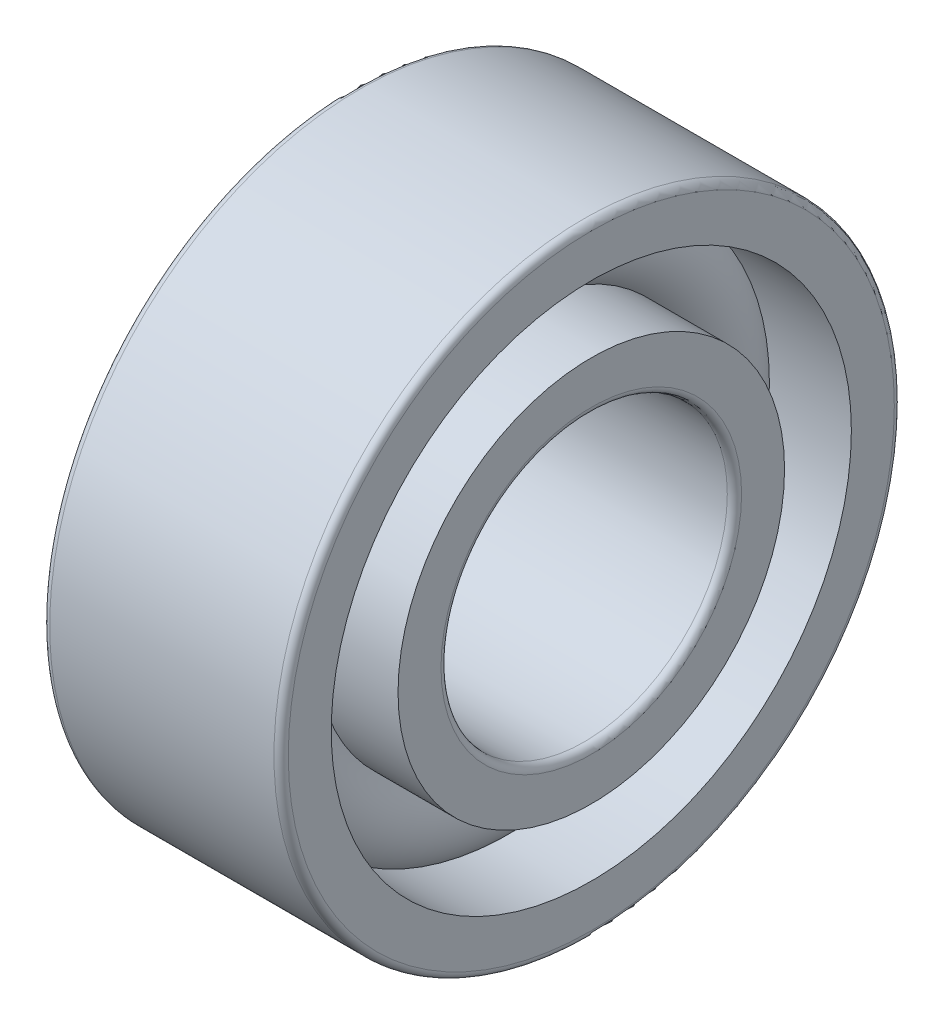
ISO-10303-21;
HEADER;
FILE_DESCRIPTION(('STEP AP214'),'2;1');
FILE_NAME('part.step','',(''),(''),'','','');
FILE_SCHEMA(('AUTOMOTIVE_DESIGN { 1 0 10303 214 1 1 1 1 }'));
ENDSEC;
DATA;
#1=APPLICATION_CONTEXT('core data for automotive mechanical design processes');
#2=APPLICATION_PROTOCOL_DEFINITION('international standard','automotive_design',2000,#1);
#3=PRODUCT_CONTEXT('',#1,'mechanical');
#4=PRODUCT('Part','Part','',(#3));
#5=PRODUCT_RELATED_PRODUCT_CATEGORY('part','',(#4));
#6=PRODUCT_DEFINITION_FORMATION('','',#4);
#7=PRODUCT_DEFINITION_CONTEXT('part definition',#1,'design');
#8=PRODUCT_DEFINITION('design','',#6,#7);
#9=PRODUCT_DEFINITION_SHAPE('','',#8);
#10=(LENGTH_UNIT() NAMED_UNIT(*) SI_UNIT(.MILLI.,.METRE.));
#11=(NAMED_UNIT(*) PLANE_ANGLE_UNIT() SI_UNIT($,.RADIAN.));
#12=(NAMED_UNIT(*) SI_UNIT($,.STERADIAN.) SOLID_ANGLE_UNIT());
#13=UNCERTAINTY_MEASURE_WITH_UNIT(LENGTH_MEASURE(1.E-05),#10,'distance_accuracy_value','');
#14=(GEOMETRIC_REPRESENTATION_CONTEXT(3) GLOBAL_UNCERTAINTY_ASSIGNED_CONTEXT((#13)) GLOBAL_UNIT_ASSIGNED_CONTEXT((#10,
#11,#12)) REPRESENTATION_CONTEXT('',''));
#15=CARTESIAN_POINT('',(0.,0.,0.));
#16=DIRECTION('',(0.,0.,1.));
#17=DIRECTION('',(1.,0.,0.));
#18=AXIS2_PLACEMENT_3D('',#15,#16,#17);
#19=CARTESIAN_POINT('',(0.,0.,0.));
#20=DIRECTION('',(-1.,0.,0.));
#21=DIRECTION('',(0.,0.,1.));
#22=AXIS2_PLACEMENT_3D('',#19,#20,#21);
#23=TOROIDAL_SURFACE('',#22,4.75,1.05);
#24=CARTESIAN_POINT('',(0.782623792124922,0.,0.));
#25=DIRECTION('',(-1.,0.,0.));
#26=DIRECTION('',(0.,0.,1.));
#27=AXIS2_PLACEMENT_3D('',#24,#25,#26);
#28=CIRCLE('',#27,5.45000000000001);
#29=CARTESIAN_POINT('',(0.782623792124922,0.,5.45000000000001));
#30=VERTEX_POINT('',#29);
#31=EDGE_CURVE('E34',#30,#30,#28,.F.);
#32=ORIENTED_EDGE('',*,*,#31,.T.);
#33=EDGE_LOOP('',(#32));
#34=FACE_BOUND('',#33,.T.);
#35=CARTESIAN_POINT('',(0.782623792124926,0.,0.));
#36=DIRECTION('',(-1.,0.,0.));
#37=DIRECTION('',(0.,0.,1.));
#38=AXIS2_PLACEMENT_3D('',#35,#36,#37);
#39=CIRCLE('',#38,4.05);
#40=CARTESIAN_POINT('',(0.782623792124926,0.,4.05));
#41=VERTEX_POINT('',#40);
#42=EDGE_CURVE('E10',#41,#41,#39,.T.);
#43=ORIENTED_EDGE('',*,*,#42,.T.);
#44=EDGE_LOOP('',(#43));
#45=FACE_BOUND('',#44,.T.);
#46=ADVANCED_FACE('F30',(#34,#45),#23,.T.);
#47=CARTESIAN_POINT('',(-20.6375,0.,0.));
#48=DIRECTION('',(1.,0.,0.));
#49=DIRECTION('',(0.,0.,-1.));
#50=AXIS2_PLACEMENT_3D('',#47,#48,#49);
#51=CYLINDRICAL_SURFACE('',#50,4.05);
#52=CARTESIAN_POINT('',(2.5,0.,0.));
#53=DIRECTION('',(1.,0.,0.));
#54=DIRECTION('',(0.,0.,-1.));
#55=AXIS2_PLACEMENT_3D('',#52,#53,#54);
#56=CIRCLE('',#55,4.05);
#57=CARTESIAN_POINT('',(2.5,0.,-4.05));
#58=VERTEX_POINT('',#57);
#59=EDGE_CURVE('E43',#58,#58,#56,.T.);
#60=ORIENTED_EDGE('',*,*,#59,.F.);
#61=EDGE_LOOP('',(#60));
#62=FACE_BOUND('',#61,.T.);
#63=ORIENTED_EDGE('',*,*,#42,.F.);
#64=EDGE_LOOP('',(#63));
#65=FACE_BOUND('',#64,.T.);
#66=ADVANCED_FACE('F82',(#62,#65),#51,.T.);
#67=CARTESIAN_POINT('',(-20.6375,0.,0.));
#68=DIRECTION('',(1.,0.,0.));
#69=DIRECTION('',(0.,0.,-1.));
#70=AXIS2_PLACEMENT_3D('',#67,#68,#69);
#71=CYLINDRICAL_SURFACE('',#70,4.05);
#72=CARTESIAN_POINT('',(-2.5,0.,0.));
#73=DIRECTION('',(1.,0.,0.));
#74=DIRECTION('',(0.,0.,-1.));
#75=AXIS2_PLACEMENT_3D('',#72,#73,#74);
#76=CIRCLE('',#75,4.05);
#77=CARTESIAN_POINT('',(-2.5,0.,-4.05));
#78=VERTEX_POINT('',#77);
#79=EDGE_CURVE('E52',#78,#78,#76,.T.);
#80=ORIENTED_EDGE('',*,*,#79,.T.);
#81=EDGE_LOOP('',(#80));
#82=FACE_BOUND('',#81,.T.);
#83=CARTESIAN_POINT('',(-0.782623792124926,0.,0.));
#84=DIRECTION('',(1.,0.,0.));
#85=DIRECTION('',(0.,0.,-1.));
#86=AXIS2_PLACEMENT_3D('',#83,#84,#85);
#87=CIRCLE('',#86,4.05);
#88=CARTESIAN_POINT('',(-0.782623792124926,0.,-4.05));
#89=VERTEX_POINT('',#88);
#90=EDGE_CURVE('E38',#89,#89,#87,.T.);
#91=ORIENTED_EDGE('',*,*,#90,.F.);
#92=EDGE_LOOP('',(#91));
#93=FACE_BOUND('',#92,.T.);
#94=ADVANCED_FACE('F85',(#82,#93),#71,.T.);
#95=CARTESIAN_POINT('',(2.5,3.15,0.));
#96=DIRECTION('',(1.,0.,0.));
#97=DIRECTION('',(0.,0.,-1.));
#98=AXIS2_PLACEMENT_3D('',#95,#96,#97);
#99=PLANE('',#98);
#100=ORIENTED_EDGE('',*,*,#59,.T.);
#101=EDGE_LOOP('',(#100));
#102=FACE_BOUND('',#101,.T.);
#103=CARTESIAN_POINT('',(2.5,0.,0.));
#104=DIRECTION('',(1.,0.,0.));
#105=DIRECTION('',(0.,0.,-1.));
#106=AXIS2_PLACEMENT_3D('',#103,#104,#105);
#107=CIRCLE('',#106,3.15);
#108=CARTESIAN_POINT('',(2.5,0.,-3.15));
#109=VERTEX_POINT('',#108);
#110=EDGE_CURVE('E74',#109,#109,#107,.T.);
#111=ORIENTED_EDGE('',*,*,#110,.F.);
#112=EDGE_LOOP('',(#111));
#113=FACE_BOUND('',#112,.T.);
#114=ADVANCED_FACE('F79',(#102,#113),#99,.T.);
#115=CARTESIAN_POINT('',(2.35,0.,0.));
#116=DIRECTION('',(1.,0.,0.));
#117=DIRECTION('',(0.,0.,-1.));
#118=AXIS2_PLACEMENT_3D('',#115,#116,#117);
#119=TOROIDAL_SURFACE('',#118,3.15,0.15);
#120=ORIENTED_EDGE('',*,*,#110,.T.);
#121=EDGE_LOOP('',(#120));
#122=FACE_BOUND('',#121,.T.);
#123=CARTESIAN_POINT('',(2.35,0.,0.));
#124=DIRECTION('',(1.,0.,0.));
#125=DIRECTION('',(0.,0.,-1.));
#126=AXIS2_PLACEMENT_3D('',#123,#124,#125);
#127=CIRCLE('',#126,3.);
#128=CARTESIAN_POINT('',(2.35,0.,-3.));
#129=VERTEX_POINT('',#128);
#130=EDGE_CURVE('E71',#129,#129,#127,.T.);
#131=ORIENTED_EDGE('',*,*,#130,.F.);
#132=EDGE_LOOP('',(#131));
#133=FACE_BOUND('',#132,.T.);
#134=ADVANCED_FACE('F96',(#122,#133),#119,.T.);
#135=CARTESIAN_POINT('',(-20.6375,0.,0.));
#136=DIRECTION('',(1.,0.,0.));
#137=DIRECTION('',(0.,0.,-1.));
#138=AXIS2_PLACEMENT_3D('',#135,#136,#137);
#139=CYLINDRICAL_SURFACE('',#138,3.);
#140=ORIENTED_EDGE('',*,*,#130,.T.);
#141=EDGE_LOOP('',(#140));
#142=FACE_BOUND('',#141,.T.);
#143=CARTESIAN_POINT('',(-2.35,0.,0.));
#144=DIRECTION('',(1.,0.,0.));
#145=DIRECTION('',(0.,0.,-1.));
#146=AXIS2_PLACEMENT_3D('',#143,#144,#145);
#147=CIRCLE('',#146,3.);
#148=CARTESIAN_POINT('',(-2.35,0.,-3.));
#149=VERTEX_POINT('',#148);
#150=EDGE_CURVE('E68',#149,#149,#147,.T.);
#151=ORIENTED_EDGE('',*,*,#150,.F.);
#152=EDGE_LOOP('',(#151));
#153=FACE_BOUND('',#152,.T.);
#154=ADVANCED_FACE('F99',(#142,#153),#139,.F.);
#155=CARTESIAN_POINT('',(-2.35,0.,0.));
#156=DIRECTION('',(1.,0.,0.));
#157=DIRECTION('',(0.,0.,-1.));
#158=AXIS2_PLACEMENT_3D('',#155,#156,#157);
#159=TOROIDAL_SURFACE('',#158,3.15,0.15);
#160=ORIENTED_EDGE('',*,*,#150,.T.);
#161=EDGE_LOOP('',(#160));
#162=FACE_BOUND('',#161,.T.);
#163=CARTESIAN_POINT('',(-2.5,0.,0.));
#164=DIRECTION('',(1.,0.,0.));
#165=DIRECTION('',(0.,0.,-1.));
#166=AXIS2_PLACEMENT_3D('',#163,#164,#165);
#167=CIRCLE('',#166,3.15);
#168=CARTESIAN_POINT('',(-2.5,0.,-3.15));
#169=VERTEX_POINT('',#168);
#170=EDGE_CURVE('E65',#169,#169,#167,.T.);
#171=ORIENTED_EDGE('',*,*,#170,.F.);
#172=EDGE_LOOP('',(#171));
#173=FACE_BOUND('',#172,.T.);
#174=ADVANCED_FACE('F103',(#162,#173),#159,.T.);
#175=CARTESIAN_POINT('',(-2.5,4.05,0.));
#176=DIRECTION('',(-1.,0.,0.));
#177=DIRECTION('',(0.,0.,1.));
#178=AXIS2_PLACEMENT_3D('',#175,#176,#177);
#179=PLANE('',#178);
#180=ORIENTED_EDGE('',*,*,#170,.T.);
#181=EDGE_LOOP('',(#180));
#182=FACE_BOUND('',#181,.T.);
#183=ORIENTED_EDGE('',*,*,#79,.F.);
#184=EDGE_LOOP('',(#183));
#185=FACE_BOUND('',#184,.T.);
#186=ADVANCED_FACE('F107',(#182,#185),#179,.T.);
#187=CARTESIAN_POINT('',(-0.782623792124922,0.,0.));
#188=DIRECTION('',(1.,0.,0.));
#189=DIRECTION('',(0.,0.,-1.));
#190=AXIS2_PLACEMENT_3D('',#187,#188,#189);
#191=CIRCLE('',#190,5.45000000000001);
#192=CARTESIAN_POINT('',(-0.782623792124922,0.,-5.45000000000001));
#193=VERTEX_POINT('',#192);
#194=EDGE_CURVE('E46',#193,#193,#191,.F.);
#195=ORIENTED_EDGE('',*,*,#194,.T.);
#196=EDGE_LOOP('',(#195));
#197=FACE_BOUND('',#196,.T.);
#198=ORIENTED_EDGE('',*,*,#90,.T.);
#199=EDGE_LOOP('',(#198));
#200=FACE_BOUND('',#199,.T.);
#201=ADVANCED_FACE('F32',(#197,#200),#23,.T.);
#202=CARTESIAN_POINT('',(-20.6375,0.,0.));
#203=DIRECTION('',(1.,0.,0.));
#204=DIRECTION('',(0.,0.,-1.));
#205=AXIS2_PLACEMENT_3D('',#202,#203,#204);
#206=CYLINDRICAL_SURFACE('',#205,5.45000000000001);
#207=CARTESIAN_POINT('',(2.5,0.,0.));
#208=DIRECTION('',(1.,0.,0.));
#209=DIRECTION('',(0.,0.,-1.));
#210=AXIS2_PLACEMENT_3D('',#207,#208,#209);
#211=CIRCLE('',#210,5.45000000000001);
#212=CARTESIAN_POINT('',(2.5,0.,-5.45000000000001));
#213=VERTEX_POINT('',#212);
#214=EDGE_CURVE('E48',#213,#213,#211,.T.);
#215=ORIENTED_EDGE('',*,*,#214,.T.);
#216=EDGE_LOOP('',(#215));
#217=FACE_BOUND('',#216,.T.);
#218=ORIENTED_EDGE('',*,*,#31,.F.);
#219=EDGE_LOOP('',(#218));
#220=FACE_BOUND('',#219,.T.);
#221=ADVANCED_FACE('F112',(#217,#220),#206,.F.);
#222=CARTESIAN_POINT('',(-20.6375,0.,0.));
#223=DIRECTION('',(1.,0.,0.));
#224=DIRECTION('',(0.,0.,-1.));
#225=AXIS2_PLACEMENT_3D('',#222,#223,#224);
#226=CYLINDRICAL_SURFACE('',#225,5.45000000000001);
#227=CARTESIAN_POINT('',(-2.5,0.,0.));
#228=DIRECTION('',(1.,0.,0.));
#229=DIRECTION('',(0.,0.,-1.));
#230=AXIS2_PLACEMENT_3D('',#227,#228,#229);
#231=CIRCLE('',#230,5.45000000000001);
#232=CARTESIAN_POINT('',(-2.5,0.,-5.45000000000001));
#233=VERTEX_POINT('',#232);
#234=EDGE_CURVE('E143',#233,#233,#231,.T.);
#235=ORIENTED_EDGE('',*,*,#234,.F.);
#236=EDGE_LOOP('',(#235));
#237=FACE_BOUND('',#236,.T.);
#238=ORIENTED_EDGE('',*,*,#194,.F.);
#239=EDGE_LOOP('',(#238));
#240=FACE_BOUND('',#239,.T.);
#241=ADVANCED_FACE('F115',(#237,#240),#226,.F.);
#242=CARTESIAN_POINT('',(2.5,6.35,0.));
#243=DIRECTION('',(1.,0.,0.));
#244=DIRECTION('',(0.,0.,-1.));
#245=AXIS2_PLACEMENT_3D('',#242,#243,#244);
#246=PLANE('',#245);
#247=CARTESIAN_POINT('',(2.5,0.,0.));
#248=DIRECTION('',(1.,0.,0.));
#249=DIRECTION('',(0.,0.,-1.));
#250=AXIS2_PLACEMENT_3D('',#247,#248,#249);
#251=CIRCLE('',#250,6.35);
#252=CARTESIAN_POINT('',(2.5,0.,-6.35));
#253=VERTEX_POINT('',#252);
#254=EDGE_CURVE('E54',#253,#253,#251,.T.);
#255=ORIENTED_EDGE('',*,*,#254,.T.);
#256=EDGE_LOOP('',(#255));
#257=FACE_BOUND('',#256,.T.);
#258=ORIENTED_EDGE('',*,*,#214,.F.);
#259=EDGE_LOOP('',(#258));
#260=FACE_BOUND('',#259,.T.);
#261=ADVANCED_FACE('F116',(#257,#260),#246,.T.);
#262=CARTESIAN_POINT('',(2.35,0.,0.));
#263=DIRECTION('',(1.,0.,0.));
#264=DIRECTION('',(0.,0.,-1.));
#265=AXIS2_PLACEMENT_3D('',#262,#263,#264);
#266=TOROIDAL_SURFACE('',#265,6.35,0.15);
#267=CARTESIAN_POINT('',(2.35,0.,0.));
#268=DIRECTION('',(1.,0.,0.));
#269=DIRECTION('',(0.,0.,-1.));
#270=AXIS2_PLACEMENT_3D('',#267,#268,#269);
#271=CIRCLE('',#270,6.50000000000001);
#272=CARTESIAN_POINT('',(2.35,0.,-6.50000000000001));
#273=VERTEX_POINT('',#272);
#274=EDGE_CURVE('E59',#273,#273,#271,.T.);
#275=ORIENTED_EDGE('',*,*,#274,.T.);
#276=EDGE_LOOP('',(#275));
#277=FACE_BOUND('',#276,.T.);
#278=ORIENTED_EDGE('',*,*,#254,.F.);
#279=EDGE_LOOP('',(#278));
#280=FACE_BOUND('',#279,.T.);
#281=ADVANCED_FACE('F119',(#277,#280),#266,.T.);
#282=CARTESIAN_POINT('',(-20.6375,0.,0.));
#283=DIRECTION('',(1.,0.,0.));
#284=DIRECTION('',(0.,0.,-1.));
#285=AXIS2_PLACEMENT_3D('',#282,#283,#284);
#286=CYLINDRICAL_SURFACE('',#285,6.50000000000001);
#287=CARTESIAN_POINT('',(-2.35,0.,0.));
#288=DIRECTION('',(1.,0.,0.));
#289=DIRECTION('',(0.,0.,-1.));
#290=AXIS2_PLACEMENT_3D('',#287,#288,#289);
#291=CIRCLE('',#290,6.50000000000001);
#292=CARTESIAN_POINT('',(-2.35,0.,-6.50000000000001));
#293=VERTEX_POINT('',#292);
#294=EDGE_CURVE('E147',#293,#293,#291,.T.);
#295=ORIENTED_EDGE('',*,*,#294,.T.);
#296=EDGE_LOOP('',(#295));
#297=FACE_BOUND('',#296,.T.);
#298=ORIENTED_EDGE('',*,*,#274,.F.);
#299=EDGE_LOOP('',(#298));
#300=FACE_BOUND('',#299,.T.);
#301=ADVANCED_FACE('F123',(#297,#300),#286,.T.);
#302=CARTESIAN_POINT('',(-2.35,0.,0.));
#303=DIRECTION('',(1.,0.,0.));
#304=DIRECTION('',(0.,0.,-1.));
#305=AXIS2_PLACEMENT_3D('',#302,#303,#304);
#306=TOROIDAL_SURFACE('',#305,6.35,0.15);
#307=CARTESIAN_POINT('',(-2.5,0.,0.));
#308=DIRECTION('',(1.,0.,0.));
#309=DIRECTION('',(0.,0.,-1.));
#310=AXIS2_PLACEMENT_3D('',#307,#308,#309);
#311=CIRCLE('',#310,6.35);
#312=CARTESIAN_POINT('',(-2.5,0.,-6.35));
#313=VERTEX_POINT('',#312);
#314=EDGE_CURVE('E144',#313,#313,#311,.T.);
#315=ORIENTED_EDGE('',*,*,#314,.T.);
#316=EDGE_LOOP('',(#315));
#317=FACE_BOUND('',#316,.T.);
#318=ORIENTED_EDGE('',*,*,#294,.F.);
#319=EDGE_LOOP('',(#318));
#320=FACE_BOUND('',#319,.T.);
#321=ADVANCED_FACE('F127',(#317,#320),#306,.T.);
#322=CARTESIAN_POINT('',(-2.5,5.45000000000001,0.));
#323=DIRECTION('',(-1.,0.,0.));
#324=DIRECTION('',(0.,0.,1.));
#325=AXIS2_PLACEMENT_3D('',#322,#323,#324);
#326=PLANE('',#325);
#327=ORIENTED_EDGE('',*,*,#234,.T.);
#328=EDGE_LOOP('',(#327));
#329=FACE_BOUND('',#328,.T.);
#330=ORIENTED_EDGE('',*,*,#314,.F.);
#331=EDGE_LOOP('',(#330));
#332=FACE_BOUND('',#331,.T.);
#333=ADVANCED_FACE('F131',(#329,#332),#326,.T.);
#334=CLOSED_SHELL('',(#46,#66,#94,#114,#134,#154,#174,#186,#201,#221,#241,#261,#281,#301,#321,#333));
#335=MANIFOLD_SOLID_BREP('B2',#334);
#336=ADVANCED_BREP_SHAPE_REPRESENTATION('',(#18,#335),#14);
#337=SHAPE_DEFINITION_REPRESENTATION(#9,#336);
ENDSEC;
END-ISO-10303-21;
